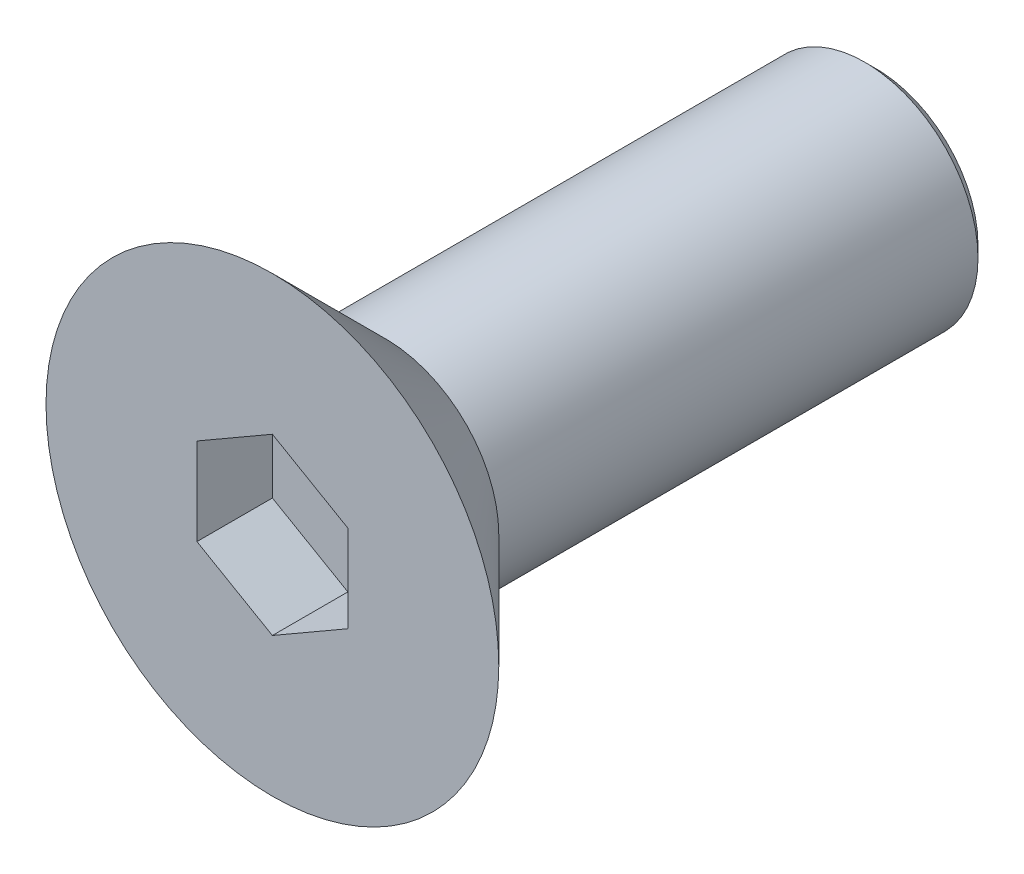
ISO-10303-21;
HEADER;
FILE_DESCRIPTION(('STEP AP214'),'2;1');
FILE_NAME('part.step','',(''),(''),'','','');
FILE_SCHEMA(('AUTOMOTIVE_DESIGN { 1 0 10303 214 1 1 1 1 }'));
ENDSEC;
DATA;
#1=APPLICATION_CONTEXT('core data for automotive mechanical design processes');
#2=APPLICATION_PROTOCOL_DEFINITION('international standard','automotive_design',2000,#1);
#3=PRODUCT_CONTEXT('',#1,'mechanical');
#4=PRODUCT('Part','Part','',(#3));
#5=PRODUCT_RELATED_PRODUCT_CATEGORY('part','',(#4));
#6=PRODUCT_DEFINITION_FORMATION('','',#4);
#7=PRODUCT_DEFINITION_CONTEXT('part definition',#1,'design');
#8=PRODUCT_DEFINITION('design','',#6,#7);
#9=PRODUCT_DEFINITION_SHAPE('','',#8);
#10=(LENGTH_UNIT() NAMED_UNIT(*) SI_UNIT(.MILLI.,.METRE.));
#11=(NAMED_UNIT(*) PLANE_ANGLE_UNIT() SI_UNIT($,.RADIAN.));
#12=(NAMED_UNIT(*) SI_UNIT($,.STERADIAN.) SOLID_ANGLE_UNIT());
#13=UNCERTAINTY_MEASURE_WITH_UNIT(LENGTH_MEASURE(1.E-05),#10,'distance_accuracy_value','');
#14=(GEOMETRIC_REPRESENTATION_CONTEXT(3) GLOBAL_UNCERTAINTY_ASSIGNED_CONTEXT((#13)) GLOBAL_UNIT_ASSIGNED_CONTEXT((#10,
#11,#12)) REPRESENTATION_CONTEXT('',''));
#15=CARTESIAN_POINT('',(0.,0.,0.));
#16=DIRECTION('',(0.,0.,1.));
#17=DIRECTION('',(1.,0.,0.));
#18=AXIS2_PLACEMENT_3D('',#15,#16,#17);
#19=CARTESIAN_POINT('',(0.,0.,3.));
#20=DIRECTION('',(0.,0.,1.));
#21=DIRECTION('',(1.,0.,0.));
#22=AXIS2_PLACEMENT_3D('',#19,#20,#21);
#23=PLANE('',#22);
#24=DIRECTION('',(-0.866025403784439,0.5,0.));
#25=VECTOR('',#24,1.);
#26=CARTESIAN_POINT('',(2.,1.15470053837925,3.));
#27=LINE('',#26,#25);
#28=CARTESIAN_POINT('',(2.,1.15470053837925,3.));
#29=VERTEX_POINT('',#28);
#30=CARTESIAN_POINT('',(0.,2.3094010767585,3.));
#31=VERTEX_POINT('',#30);
#32=EDGE_CURVE('E49',#29,#31,#27,.T.);
#33=ORIENTED_EDGE('',*,*,#32,.F.);
#34=DIRECTION('',(0.,1.,0.));
#35=VECTOR('',#34,1.);
#36=CARTESIAN_POINT('',(2.,-1.15470053837925,3.));
#37=LINE('',#36,#35);
#38=CARTESIAN_POINT('',(2.,-1.15470053837925,3.));
#39=VERTEX_POINT('',#38);
#40=EDGE_CURVE('E132',#39,#29,#37,.T.);
#41=ORIENTED_EDGE('',*,*,#40,.F.);
#42=DIRECTION('',(0.866025403784439,0.5,0.));
#43=VECTOR('',#42,1.);
#44=CARTESIAN_POINT('',(0.,-2.3094010767585,3.));
#45=LINE('',#44,#43);
#46=CARTESIAN_POINT('',(0.,-2.3094010767585,3.));
#47=VERTEX_POINT('',#46);
#48=EDGE_CURVE('E130',#47,#39,#45,.T.);
#49=ORIENTED_EDGE('',*,*,#48,.F.);
#50=DIRECTION('',(0.866025403784438,-0.5,0.));
#51=VECTOR('',#50,1.);
#52=CARTESIAN_POINT('',(-2.,-1.15470053837925,3.));
#53=LINE('',#52,#51);
#54=CARTESIAN_POINT('',(-2.,-1.15470053837925,3.));
#55=VERTEX_POINT('',#54);
#56=EDGE_CURVE('E97',#55,#47,#53,.T.);
#57=ORIENTED_EDGE('',*,*,#56,.F.);
#58=DIRECTION('',(0.,-1.,0.));
#59=VECTOR('',#58,1.);
#60=CARTESIAN_POINT('',(-2.,1.15470053837925,3.));
#61=LINE('',#60,#59);
#62=CARTESIAN_POINT('',(-2.,1.15470053837925,3.));
#63=VERTEX_POINT('',#62);
#64=EDGE_CURVE('E126',#63,#55,#61,.T.);
#65=ORIENTED_EDGE('',*,*,#64,.F.);
#66=DIRECTION('',(-0.866025403784439,-0.5,0.));
#67=VECTOR('',#66,1.);
#68=CARTESIAN_POINT('',(0.,2.3094010767585,3.));
#69=LINE('',#68,#67);
#70=EDGE_CURVE('E123',#31,#63,#69,.T.);
#71=ORIENTED_EDGE('',*,*,#70,.F.);
#72=EDGE_LOOP('',(#33,#41,#49,#57,#65,#71));
#73=FACE_BOUND('',#72,.T.);
#74=CARTESIAN_POINT('',(0.,0.,3.));
#75=DIRECTION('',(0.,0.,1.));
#76=DIRECTION('',(1.,0.,0.));
#77=AXIS2_PLACEMENT_3D('',#74,#75,#76);
#78=CIRCLE('',#77,6.);
#79=CARTESIAN_POINT('',(6.,0.,3.));
#80=VERTEX_POINT('',#79);
#81=EDGE_CURVE('E136',#80,#80,#78,.T.);
#82=ORIENTED_EDGE('',*,*,#81,.T.);
#83=EDGE_LOOP('',(#82));
#84=FACE_BOUND('',#83,.T.);
#85=ADVANCED_FACE('F34',(#73,#84),#23,.T.);
#86=CARTESIAN_POINT('',(0.,0.,-13.));
#87=DIRECTION('',(0.,0.,1.));
#88=DIRECTION('',(1.,0.,0.));
#89=AXIS2_PLACEMENT_3D('',#86,#87,#88);
#90=CYLINDRICAL_SURFACE('',#89,3.);
#91=CARTESIAN_POINT('',(0.,0.,-12.7));
#92=DIRECTION('',(0.,0.,-1.));
#93=DIRECTION('',(-1.,0.,0.));
#94=AXIS2_PLACEMENT_3D('',#91,#92,#93);
#95=CIRCLE('',#94,3.);
#96=CARTESIAN_POINT('',(3.,0.,-12.7));
#97=VERTEX_POINT('',#96);
#98=EDGE_CURVE('E11',#97,#97,#95,.F.);
#99=CARTESIAN_POINT('',(0.,0.,0.));
#100=DIRECTION('',(0.,0.,1.));
#101=DIRECTION('',(1.,0.,0.));
#102=AXIS2_PLACEMENT_3D('',#99,#100,#101);
#103=CIRCLE('',#102,3.);
#104=CARTESIAN_POINT('',(3.,0.,0.));
#105=VERTEX_POINT('',#104);
#106=EDGE_CURVE('E144',#105,#105,#103,.F.);
#107=CARTESIAN_POINT('',(3.,0.,-12.7));
#108=CARTESIAN_POINT('',(3.,0.,-12.5677083333333));
#109=CARTESIAN_POINT('',(3.,0.,-12.4354166666667));
#110=CARTESIAN_POINT('',(3.,0.,-12.1708333333333));
#111=CARTESIAN_POINT('',(3.,0.,-12.0385416666667));
#112=CARTESIAN_POINT('',(3.,0.,-11.7739583333333));
#113=CARTESIAN_POINT('',(3.,0.,-11.6416666666667));
#114=CARTESIAN_POINT('',(3.,0.,-11.3770833333333));
#115=CARTESIAN_POINT('',(3.,0.,-11.2447916666667));
#116=CARTESIAN_POINT('',(3.,0.,-10.9802083333333));
#117=CARTESIAN_POINT('',(3.,0.,-10.8479166666667));
#118=CARTESIAN_POINT('',(3.,0.,-10.5833333333333));
#119=CARTESIAN_POINT('',(3.,0.,-10.4510416666667));
#120=CARTESIAN_POINT('',(3.,0.,-10.1864583333333));
#121=CARTESIAN_POINT('',(3.,0.,-10.0541666666667));
#122=CARTESIAN_POINT('',(3.,0.,-9.78958333333334));
#123=CARTESIAN_POINT('',(3.,0.,-9.65729166666667));
#124=CARTESIAN_POINT('',(3.,0.,-9.39270833333334));
#125=CARTESIAN_POINT('',(3.,0.,-9.26041666666667));
#126=CARTESIAN_POINT('',(3.,0.,-8.99583333333334));
#127=CARTESIAN_POINT('',(3.,0.,-8.86354166666667));
#128=CARTESIAN_POINT('',(3.,0.,-8.59895833333334));
#129=CARTESIAN_POINT('',(3.,0.,-8.46666666666667));
#130=CARTESIAN_POINT('',(3.,0.,-8.20208333333334));
#131=CARTESIAN_POINT('',(3.,0.,-8.06979166666667));
#132=CARTESIAN_POINT('',(3.,0.,-7.80520833333334));
#133=CARTESIAN_POINT('',(3.,0.,-7.67291666666667));
#134=CARTESIAN_POINT('',(3.,0.,-7.40833333333334));
#135=CARTESIAN_POINT('',(3.,0.,-7.27604166666667));
#136=CARTESIAN_POINT('',(3.,0.,-7.01145833333334));
#137=CARTESIAN_POINT('',(3.,0.,-6.87916666666667));
#138=CARTESIAN_POINT('',(3.,0.,-6.61458333333334));
#139=CARTESIAN_POINT('',(3.,0.,-6.48229166666667));
#140=CARTESIAN_POINT('',(3.,0.,-6.21770833333334));
#141=CARTESIAN_POINT('',(3.,0.,-6.08541666666667));
#142=CARTESIAN_POINT('',(3.,0.,-5.82083333333334));
#143=CARTESIAN_POINT('',(3.,0.,-5.68854166666667));
#144=CARTESIAN_POINT('',(3.,0.,-5.42395833333334));
#145=CARTESIAN_POINT('',(3.,0.,-5.29166666666667));
#146=CARTESIAN_POINT('',(3.,0.,-5.02708333333334));
#147=CARTESIAN_POINT('',(3.,0.,-4.89479166666667));
#148=CARTESIAN_POINT('',(3.,0.,-4.63020833333334));
#149=CARTESIAN_POINT('',(3.,0.,-4.49791666666667));
#150=CARTESIAN_POINT('',(3.,0.,-4.23333333333333));
#151=CARTESIAN_POINT('',(3.,0.,-4.10104166666667));
#152=CARTESIAN_POINT('',(3.,0.,-3.83645833333334));
#153=CARTESIAN_POINT('',(3.,0.,-3.70416666666667));
#154=CARTESIAN_POINT('',(3.,0.,-3.43958333333333));
#155=CARTESIAN_POINT('',(3.,0.,-3.30729166666667));
#156=CARTESIAN_POINT('',(3.,0.,-3.04270833333333));
#157=CARTESIAN_POINT('',(3.,0.,-2.91041666666667));
#158=CARTESIAN_POINT('',(3.,0.,-2.64583333333333));
#159=CARTESIAN_POINT('',(3.,0.,-2.51354166666667));
#160=CARTESIAN_POINT('',(3.,0.,-2.24895833333334));
#161=CARTESIAN_POINT('',(3.,0.,-2.11666666666667));
#162=CARTESIAN_POINT('',(3.,0.,-1.85208333333333));
#163=CARTESIAN_POINT('',(3.,0.,-1.71979166666667));
#164=CARTESIAN_POINT('',(3.,0.,-1.45520833333333));
#165=CARTESIAN_POINT('',(3.,0.,-1.32291666666667));
#166=CARTESIAN_POINT('',(3.,0.,-1.05833333333333));
#167=CARTESIAN_POINT('',(3.,0.,-0.926041666666668));
#168=CARTESIAN_POINT('',(3.,0.,-0.661458333333334));
#169=CARTESIAN_POINT('',(3.,0.,-0.529166666666667));
#170=CARTESIAN_POINT('',(3.,0.,-0.264583333333333));
#171=CARTESIAN_POINT('',(3.,0.,-0.132291666666667));
#172=CARTESIAN_POINT('',(3.,0.,0.));
#173=B_SPLINE_CURVE_WITH_KNOTS('',3,(#107,#108,#109,#110,#111,#112,#113,#114,#115,#116,#117,
#118,#119,#120,#121,#122,#123,#124,#125,#126,#127,#128,#129,#130,#131,#132,#133,#134,#135,#136,
#137,#138,#139,#140,#141,#142,#143,#144,#145,#146,#147,#148,#149,#150,#151,#152,#153,#154,#155,
#156,#157,#158,#159,#160,#161,#162,#163,#164,#165,#166,#167,#168,#169,#170,#171,#172),
.UNSPECIFIED.,.F.,.F.,(4,2,2,2,2,2,2,2,2,2,2,2,2,2,2,2,2,2,2,2,2,2,2,2,2,2,2,2,2,2,2,2,4),(0.,
0.396875,0.793749999999999,1.190625,1.5875,1.984375,2.38125,2.778125,3.175,3.571875,3.96875,
4.365625,4.7625,5.159375,5.55625,5.953125,6.35,6.746875,7.14375,7.540625,7.9375,8.334375,
8.73125,9.128125,9.525,9.921875,10.31875,10.715625,11.1125,11.509375,11.90625,12.303125,12.7),.UNSPECIFIED.);
#174=EDGE_CURVE('BSEAM161',#97,#105,#173,.T.);
#175=ORIENTED_EDGE('',*,*,#98,.T.);
#176=ORIENTED_EDGE('',*,*,#106,.T.);
#177=ORIENTED_EDGE('',*,*,#174,.T.);
#178=ORIENTED_EDGE('',*,*,#174,.F.);
#179=EDGE_LOOP('',(#175,#177,#176,#178));
#180=FACE_BOUND('',#179,.T.);
#181=ADVANCED_FACE('F161',(#180),#90,.T.);
#182=CARTESIAN_POINT('',(0.,0.,-13.));
#183=DIRECTION('',(0.,0.,-1.));
#184=DIRECTION('',(-1.,0.,0.));
#185=AXIS2_PLACEMENT_3D('',#182,#183,#184);
#186=PLANE('',#185);
#187=CARTESIAN_POINT('',(0.,0.,-13.));
#188=DIRECTION('',(0.,0.,-1.));
#189=DIRECTION('',(-1.,0.,0.));
#190=AXIS2_PLACEMENT_3D('',#187,#188,#189);
#191=CIRCLE('',#190,2.70000000000001);
#192=CARTESIAN_POINT('',(-2.70000000000001,0.,-13.));
#193=VERTEX_POINT('',#192);
#194=EDGE_CURVE('E42',#193,#193,#191,.T.);
#195=ORIENTED_EDGE('',*,*,#194,.T.);
#196=EDGE_LOOP('',(#195));
#197=FACE_BOUND('',#196,.T.);
#198=ADVANCED_FACE('F149',(#197),#186,.T.);
#199=CARTESIAN_POINT('',(0.,0.,-13.));
#200=DIRECTION('',(0.,0.,1.));
#201=DIRECTION('',(1.,0.,0.));
#202=AXIS2_PLACEMENT_3D('',#199,#200,#201);
#203=CONICAL_SURFACE('',#202,2.70000000000001,0.785398163397448);
#204=ORIENTED_EDGE('',*,*,#98,.F.);
#205=EDGE_LOOP('',(#204));
#206=FACE_BOUND('',#205,.T.);
#207=ORIENTED_EDGE('',*,*,#194,.F.);
#208=EDGE_LOOP('',(#207));
#209=FACE_BOUND('',#208,.T.);
#210=ADVANCED_FACE('F151',(#206,#209),#203,.T.);
#211=CARTESIAN_POINT('',(2.,1.15470053837925,1.));
#212=DIRECTION('',(0.5,0.866025403784439,0.));
#213=DIRECTION('',(-0.866025403784439,0.5,0.));
#214=AXIS2_PLACEMENT_3D('',#211,#212,#213);
#215=PLANE('',#214);
#216=ORIENTED_EDGE('',*,*,#32,.T.);
#217=DIRECTION('',(0.,0.,1.));
#218=VECTOR('',#217,1.);
#219=CARTESIAN_POINT('',(0.,2.3094010767585,1.));
#220=LINE('',#219,#218);
#221=CARTESIAN_POINT('',(0.,2.3094010767585,1.));
#222=VERTEX_POINT('',#221);
#223=EDGE_CURVE('E79',#222,#31,#220,.T.);
#224=ORIENTED_EDGE('',*,*,#223,.F.);
#225=DIRECTION('',(-0.866025403784439,0.5,0.));
#226=VECTOR('',#225,1.);
#227=CARTESIAN_POINT('',(2.,1.15470053837925,1.));
#228=LINE('',#227,#226);
#229=CARTESIAN_POINT('',(2.,1.15470053837925,1.));
#230=VERTEX_POINT('',#229);
#231=EDGE_CURVE('E134',#230,#222,#228,.T.);
#232=ORIENTED_EDGE('',*,*,#231,.F.);
#233=DIRECTION('',(0.,0.,1.));
#234=VECTOR('',#233,1.);
#235=CARTESIAN_POINT('',(2.,1.15470053837925,1.));
#236=LINE('',#235,#234);
#237=EDGE_CURVE('E57',#230,#29,#236,.T.);
#238=ORIENTED_EDGE('',*,*,#237,.T.);
#239=EDGE_LOOP('',(#216,#224,#232,#238));
#240=FACE_BOUND('',#239,.T.);
#241=ADVANCED_FACE('F153',(#240),#215,.F.);
#242=CARTESIAN_POINT('',(2.,-1.15470053837925,1.));
#243=DIRECTION('',(1.,0.,0.));
#244=DIRECTION('',(0.,1.,0.));
#245=AXIS2_PLACEMENT_3D('',#242,#243,#244);
#246=PLANE('',#245);
#247=ORIENTED_EDGE('',*,*,#40,.T.);
#248=ORIENTED_EDGE('',*,*,#237,.F.);
#249=DIRECTION('',(0.,1.,0.));
#250=VECTOR('',#249,1.);
#251=CARTESIAN_POINT('',(2.,-1.15470053837925,1.));
#252=LINE('',#251,#250);
#253=CARTESIAN_POINT('',(2.,-1.15470053837925,1.));
#254=VERTEX_POINT('',#253);
#255=EDGE_CURVE('E109',#254,#230,#252,.T.);
#256=ORIENTED_EDGE('',*,*,#255,.F.);
#257=DIRECTION('',(0.,0.,1.));
#258=VECTOR('',#257,1.);
#259=CARTESIAN_POINT('',(2.,-1.15470053837925,1.));
#260=LINE('',#259,#258);
#261=EDGE_CURVE('E101',#254,#39,#260,.T.);
#262=ORIENTED_EDGE('',*,*,#261,.T.);
#263=EDGE_LOOP('',(#247,#248,#256,#262));
#264=FACE_BOUND('',#263,.T.);
#265=ADVANCED_FACE('F159',(#264),#246,.F.);
#266=CARTESIAN_POINT('',(0.,-2.3094010767585,1.));
#267=DIRECTION('',(0.5,-0.866025403784439,0.));
#268=DIRECTION('',(0.866025403784439,0.5,0.));
#269=AXIS2_PLACEMENT_3D('',#266,#267,#268);
#270=PLANE('',#269);
#271=ORIENTED_EDGE('',*,*,#48,.T.);
#272=ORIENTED_EDGE('',*,*,#261,.F.);
#273=DIRECTION('',(0.866025403784439,0.5,0.));
#274=VECTOR('',#273,1.);
#275=CARTESIAN_POINT('',(0.,-2.3094010767585,1.));
#276=LINE('',#275,#274);
#277=CARTESIAN_POINT('',(0.,-2.3094010767585,1.));
#278=VERTEX_POINT('',#277);
#279=EDGE_CURVE('E105',#278,#254,#276,.T.);
#280=ORIENTED_EDGE('',*,*,#279,.F.);
#281=DIRECTION('',(0.,0.,1.));
#282=VECTOR('',#281,1.);
#283=CARTESIAN_POINT('',(0.,-2.3094010767585,1.));
#284=LINE('',#283,#282);
#285=EDGE_CURVE('E90',#278,#47,#284,.T.);
#286=ORIENTED_EDGE('',*,*,#285,.T.);
#287=EDGE_LOOP('',(#271,#272,#280,#286));
#288=FACE_BOUND('',#287,.T.);
#289=ADVANCED_FACE('F106',(#288),#270,.F.);
#290=CARTESIAN_POINT('',(-2.,-1.15470053837925,1.));
#291=DIRECTION('',(-0.5,-0.866025403784439,0.));
#292=DIRECTION('',(0.866025403784438,-0.5,0.));
#293=AXIS2_PLACEMENT_3D('',#290,#291,#292);
#294=PLANE('',#293);
#295=ORIENTED_EDGE('',*,*,#56,.T.);
#296=ORIENTED_EDGE('',*,*,#285,.F.);
#297=DIRECTION('',(0.866025403784438,-0.5,0.));
#298=VECTOR('',#297,1.);
#299=CARTESIAN_POINT('',(-2.,-1.15470053837925,1.));
#300=LINE('',#299,#298);
#301=CARTESIAN_POINT('',(-2.,-1.15470053837925,1.));
#302=VERTEX_POINT('',#301);
#303=EDGE_CURVE('E94',#302,#278,#300,.T.);
#304=ORIENTED_EDGE('',*,*,#303,.F.);
#305=DIRECTION('',(0.,0.,1.));
#306=VECTOR('',#305,1.);
#307=CARTESIAN_POINT('',(-2.,-1.15470053837925,1.));
#308=LINE('',#307,#306);
#309=EDGE_CURVE('E102',#302,#55,#308,.T.);
#310=ORIENTED_EDGE('',*,*,#309,.T.);
#311=EDGE_LOOP('',(#295,#296,#304,#310));
#312=FACE_BOUND('',#311,.T.);
#313=ADVANCED_FACE('F92',(#312),#294,.F.);
#314=CARTESIAN_POINT('',(-2.,1.15470053837925,1.));
#315=DIRECTION('',(-1.,0.,0.));
#316=DIRECTION('',(0.,0.,1.));
#317=AXIS2_PLACEMENT_3D('',#314,#315,#316);
#318=PLANE('',#317);
#319=ORIENTED_EDGE('',*,*,#64,.T.);
#320=ORIENTED_EDGE('',*,*,#309,.F.);
#321=DIRECTION('',(0.,-1.,0.));
#322=VECTOR('',#321,1.);
#323=CARTESIAN_POINT('',(-2.,1.15470053837925,1.));
#324=LINE('',#323,#322);
#325=CARTESIAN_POINT('',(-2.,1.15470053837925,1.));
#326=VERTEX_POINT('',#325);
#327=EDGE_CURVE('E115',#326,#302,#324,.T.);
#328=ORIENTED_EDGE('',*,*,#327,.F.);
#329=DIRECTION('',(0.,0.,1.));
#330=VECTOR('',#329,1.);
#331=CARTESIAN_POINT('',(-2.,1.15470053837925,1.));
#332=LINE('',#331,#330);
#333=EDGE_CURVE('E139',#326,#63,#332,.T.);
#334=ORIENTED_EDGE('',*,*,#333,.T.);
#335=EDGE_LOOP('',(#319,#320,#328,#334));
#336=FACE_BOUND('',#335,.T.);
#337=ADVANCED_FACE('F177',(#336),#318,.F.);
#338=CARTESIAN_POINT('',(0.,2.3094010767585,1.));
#339=DIRECTION('',(-0.5,0.866025403784439,0.));
#340=DIRECTION('',(-0.866025403784439,-0.5,0.));
#341=AXIS2_PLACEMENT_3D('',#338,#339,#340);
#342=PLANE('',#341);
#343=ORIENTED_EDGE('',*,*,#70,.T.);
#344=ORIENTED_EDGE('',*,*,#333,.F.);
#345=DIRECTION('',(-0.866025403784439,-0.5,0.));
#346=VECTOR('',#345,1.);
#347=CARTESIAN_POINT('',(0.,2.3094010767585,1.));
#348=LINE('',#347,#346);
#349=EDGE_CURVE('E117',#222,#326,#348,.T.);
#350=ORIENTED_EDGE('',*,*,#349,.F.);
#351=ORIENTED_EDGE('',*,*,#223,.T.);
#352=EDGE_LOOP('',(#343,#344,#350,#351));
#353=FACE_BOUND('',#352,.T.);
#354=ADVANCED_FACE('F174',(#353),#342,.F.);
#355=CARTESIAN_POINT('',(0.,0.,1.));
#356=DIRECTION('',(0.,0.,1.));
#357=DIRECTION('',(1.,0.,0.));
#358=AXIS2_PLACEMENT_3D('',#355,#356,#357);
#359=PLANE('',#358);
#360=ORIENTED_EDGE('',*,*,#231,.T.);
#361=ORIENTED_EDGE('',*,*,#349,.T.);
#362=ORIENTED_EDGE('',*,*,#327,.T.);
#363=ORIENTED_EDGE('',*,*,#303,.T.);
#364=ORIENTED_EDGE('',*,*,#279,.T.);
#365=ORIENTED_EDGE('',*,*,#255,.T.);
#366=EDGE_LOOP('',(#360,#361,#362,#363,#364,#365));
#367=FACE_BOUND('',#366,.T.);
#368=ADVANCED_FACE('F112',(#367),#359,.T.);
#369=CARTESIAN_POINT('',(0.,0.,3.));
#370=DIRECTION('',(0.,0.,1.));
#371=DIRECTION('',(1.,0.,0.));
#372=AXIS2_PLACEMENT_3D('',#369,#370,#371);
#373=CONICAL_SURFACE('',#372,6.,0.78539816339745);
#374=ORIENTED_EDGE('',*,*,#106,.F.);
#375=EDGE_LOOP('',(#374));
#376=FACE_BOUND('',#375,.T.);
#377=ORIENTED_EDGE('',*,*,#81,.F.);
#378=EDGE_LOOP('',(#377));
#379=FACE_BOUND('',#378,.T.);
#380=ADVANCED_FACE('F36',(#376,#379),#373,.T.);
#381=CLOSED_SHELL('',(#85,#181,#198,#210,#241,#265,#289,#313,#337,#354,#368,#380));
#382=MANIFOLD_SOLID_BREP('B2',#381);
#383=ADVANCED_BREP_SHAPE_REPRESENTATION('',(#18,#382),#14);
#384=SHAPE_DEFINITION_REPRESENTATION(#9,#383);
ENDSEC;
END-ISO-10303-21;
